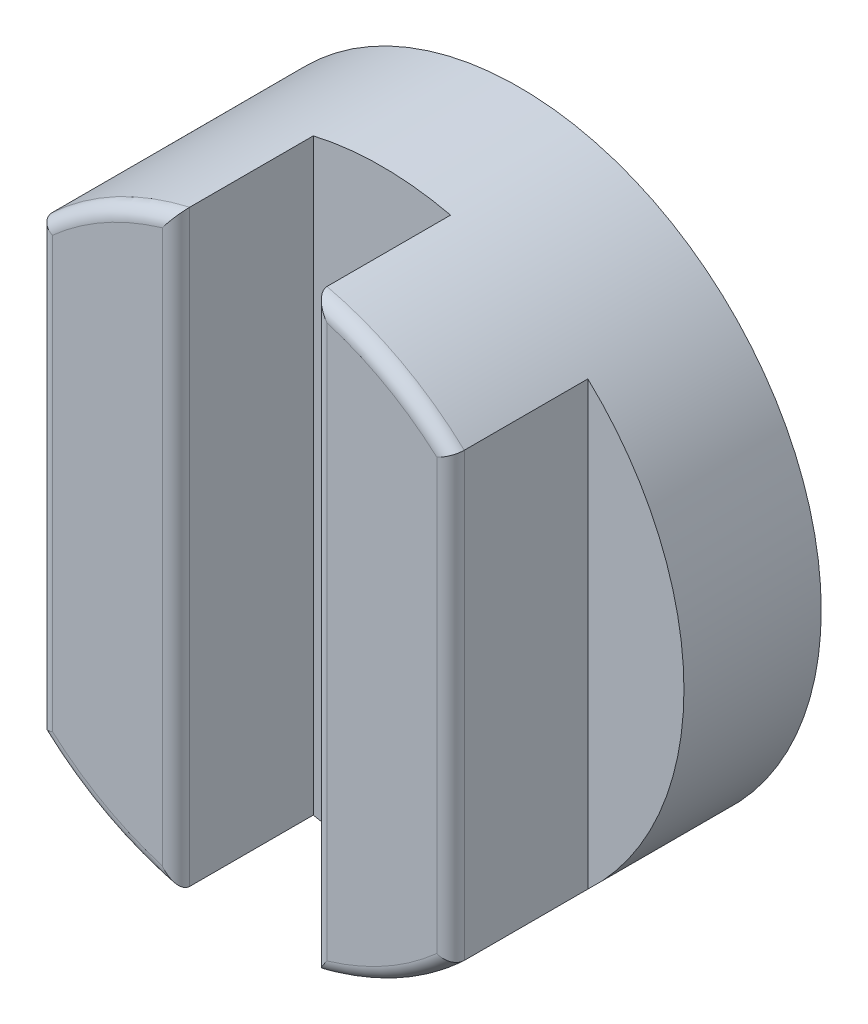
ISO-10303-21;
HEADER;
FILE_DESCRIPTION(('STEP AP214'),'2;1');
FILE_NAME('part.step','',(''),(''),'','','');
FILE_SCHEMA(('AUTOMOTIVE_DESIGN { 1 0 10303 214 1 1 1 1 }'));
ENDSEC;
DATA;
#1=APPLICATION_CONTEXT('core data for automotive mechanical design processes');
#2=APPLICATION_PROTOCOL_DEFINITION('international standard','automotive_design',2000,#1);
#3=PRODUCT_CONTEXT('',#1,'mechanical');
#4=PRODUCT('Part','Part','',(#3));
#5=PRODUCT_RELATED_PRODUCT_CATEGORY('part','',(#4));
#6=PRODUCT_DEFINITION_FORMATION('','',#4);
#7=PRODUCT_DEFINITION_CONTEXT('part definition',#1,'design');
#8=PRODUCT_DEFINITION('design','',#6,#7);
#9=PRODUCT_DEFINITION_SHAPE('','',#8);
#10=(LENGTH_UNIT() NAMED_UNIT(*) SI_UNIT(.MILLI.,.METRE.));
#11=(NAMED_UNIT(*) PLANE_ANGLE_UNIT() SI_UNIT($,.RADIAN.));
#12=(NAMED_UNIT(*) SI_UNIT($,.STERADIAN.) SOLID_ANGLE_UNIT());
#13=UNCERTAINTY_MEASURE_WITH_UNIT(LENGTH_MEASURE(1.E-05),#10,'distance_accuracy_value','');
#14=(GEOMETRIC_REPRESENTATION_CONTEXT(3) GLOBAL_UNCERTAINTY_ASSIGNED_CONTEXT((#13)) GLOBAL_UNIT_ASSIGNED_CONTEXT((#10,
#11,#12)) REPRESENTATION_CONTEXT('',''));
#15=CARTESIAN_POINT('',(0.,0.,0.));
#16=DIRECTION('',(0.,0.,1.));
#17=DIRECTION('',(1.,0.,0.));
#18=AXIS2_PLACEMENT_3D('',#15,#16,#17);
#19=CARTESIAN_POINT('',(0.,0.,5.));
#20=DIRECTION('',(0.,0.,1.));
#21=DIRECTION('',(1.,0.,0.));
#22=AXIS2_PLACEMENT_3D('',#19,#20,#21);
#23=PLANE('',#22);
#24=CARTESIAN_POINT('',(0.,0.,5.));
#25=DIRECTION('',(0.,0.,1.));
#26=DIRECTION('',(1.,0.,0.));
#27=AXIS2_PLACEMENT_3D('',#24,#25,#26);
#28=CIRCLE('',#27,11.);
#29=CARTESIAN_POINT('',(-2.5,-10.7121426428143,5.));
#30=VERTEX_POINT('',#29);
#31=CARTESIAN_POINT('',(2.5,-10.7121426428143,5.));
#32=VERTEX_POINT('',#31);
#33=EDGE_CURVE('E153',#30,#32,#28,.T.);
#34=ORIENTED_EDGE('',*,*,#33,.T.);
#35=DIRECTION('',(0.,-1.,0.));
#36=VECTOR('',#35,1.);
#37=CARTESIAN_POINT('',(2.5,0.,5.));
#38=LINE('',#37,#36);
#39=CARTESIAN_POINT('',(2.5,10.7121426428143,5.));
#40=VERTEX_POINT('',#39);
#41=EDGE_CURVE('E157',#40,#32,#38,.T.);
#42=ORIENTED_EDGE('',*,*,#41,.F.);
#43=CARTESIAN_POINT('',(-2.5,10.7121426428143,5.));
#44=VERTEX_POINT('',#43);
#45=EDGE_CURVE('E154',#40,#44,#28,.T.);
#46=ORIENTED_EDGE('',*,*,#45,.T.);
#47=DIRECTION('',(0.,-1.,0.));
#48=VECTOR('',#47,1.);
#49=CARTESIAN_POINT('',(-2.5,0.,5.));
#50=LINE('',#49,#48);
#51=EDGE_CURVE('E167',#44,#30,#50,.T.);
#52=ORIENTED_EDGE('',*,*,#51,.T.);
#53=EDGE_LOOP('',(#34,#42,#46,#52));
#54=FACE_BOUND('',#53,.T.);
#55=ADVANCED_FACE('F37',(#54),#23,.T.);
#56=DIRECTION('',(0.,-1.,0.));
#57=VECTOR('',#56,1.);
#58=CARTESIAN_POINT('',(7.5,0.,5.));
#59=LINE('',#58,#57);
#60=CARTESIAN_POINT('',(7.5,8.04673846971554,5.));
#61=VERTEX_POINT('',#60);
#62=CARTESIAN_POINT('',(7.5,-8.04673846971554,5.));
#63=VERTEX_POINT('',#62);
#64=EDGE_CURVE('E138',#61,#63,#59,.T.);
#65=ORIENTED_EDGE('',*,*,#64,.T.);
#66=EDGE_CURVE('E147',#63,#61,#28,.T.);
#67=ORIENTED_EDGE('',*,*,#66,.T.);
#68=EDGE_LOOP('',(#65,#67));
#69=FACE_BOUND('',#68,.T.);
#70=ADVANCED_FACE('F156',(#69),#23,.T.);
#71=CARTESIAN_POINT('',(0.,0.,5.));
#72=DIRECTION('',(0.,0.,-1.));
#73=DIRECTION('',(-1.,0.,0.));
#74=AXIS2_PLACEMENT_3D('',#71,#72,#73);
#75=CYLINDRICAL_SURFACE('',#74,11.);
#76=DIRECTION('',(0.,0.,-1.));
#77=VECTOR('',#76,1.);
#78=CARTESIAN_POINT('',(2.5,10.7121426428143,10.));
#79=LINE('',#78,#77);
#80=CARTESIAN_POINT('',(2.5,10.7121426428143,9.5));
#81=VERTEX_POINT('',#80);
#82=EDGE_CURVE('E165',#81,#40,#79,.T.);
#83=ORIENTED_EDGE('',*,*,#82,.F.);
#84=CARTESIAN_POINT('',(0.,0.,9.5));
#85=DIRECTION('',(0.,0.,1.));
#86=DIRECTION('',(1.,0.,0.));
#87=AXIS2_PLACEMENT_3D('',#84,#85,#86);
#88=CIRCLE('',#87,11.);
#89=CARTESIAN_POINT('',(7.5,8.04673846971554,9.5));
#90=VERTEX_POINT('',#89);
#91=EDGE_CURVE('E447',#81,#90,#88,.F.);
#92=ORIENTED_EDGE('',*,*,#91,.T.);
#93=DIRECTION('',(0.,0.,-1.));
#94=VECTOR('',#93,1.);
#95=CARTESIAN_POINT('',(7.5,8.04673846971554,10.));
#96=LINE('',#95,#94);
#97=EDGE_CURVE('E144',#90,#61,#96,.T.);
#98=ORIENTED_EDGE('',*,*,#97,.T.);
#99=ORIENTED_EDGE('',*,*,#66,.F.);
#100=DIRECTION('',(0.,0.,-1.));
#101=VECTOR('',#100,1.);
#102=CARTESIAN_POINT('',(7.5,-8.04673846971554,10.));
#103=LINE('',#102,#101);
#104=CARTESIAN_POINT('',(7.5,-8.04673846971554,9.5));
#105=VERTEX_POINT('',#104);
#106=EDGE_CURVE('E133',#105,#63,#103,.T.);
#107=ORIENTED_EDGE('',*,*,#106,.F.);
#108=CARTESIAN_POINT('',(0.,0.,9.5));
#109=DIRECTION('',(0.,0.,1.));
#110=DIRECTION('',(1.,0.,0.));
#111=AXIS2_PLACEMENT_3D('',#108,#109,#110);
#112=CIRCLE('',#111,11.);
#113=CARTESIAN_POINT('',(2.5,-10.7121426428143,9.5));
#114=VERTEX_POINT('',#113);
#115=EDGE_CURVE('E449',#105,#114,#112,.F.);
#116=ORIENTED_EDGE('',*,*,#115,.T.);
#117=DIRECTION('',(0.,0.,-1.));
#118=VECTOR('',#117,1.);
#119=CARTESIAN_POINT('',(2.5,-10.7121426428143,10.));
#120=LINE('',#119,#118);
#121=EDGE_CURVE('E143',#114,#32,#120,.T.);
#122=ORIENTED_EDGE('',*,*,#121,.T.);
#123=ORIENTED_EDGE('',*,*,#33,.F.);
#124=DIRECTION('',(0.,0.,-1.));
#125=VECTOR('',#124,1.);
#126=CARTESIAN_POINT('',(-2.5,-10.7121426428143,10.));
#127=LINE('',#126,#125);
#128=CARTESIAN_POINT('',(-2.5,-10.7121426428143,9.5));
#129=VERTEX_POINT('',#128);
#130=EDGE_CURVE('E183',#129,#30,#127,.T.);
#131=ORIENTED_EDGE('',*,*,#130,.F.);
#132=CARTESIAN_POINT('',(0.,0.,9.5));
#133=DIRECTION('',(0.,0.,1.));
#134=DIRECTION('',(1.,0.,0.));
#135=AXIS2_PLACEMENT_3D('',#132,#133,#134);
#136=CIRCLE('',#135,11.);
#137=CARTESIAN_POINT('',(-7.5,-8.04673846971554,9.5));
#138=VERTEX_POINT('',#137);
#139=EDGE_CURVE('E240',#129,#138,#136,.F.);
#140=ORIENTED_EDGE('',*,*,#139,.T.);
#141=DIRECTION('',(0.,0.,-1.));
#142=VECTOR('',#141,1.);
#143=CARTESIAN_POINT('',(-7.5,-8.04673846971554,10.));
#144=LINE('',#143,#142);
#145=CARTESIAN_POINT('',(-7.5,-8.04673846971554,5.));
#146=VERTEX_POINT('',#145);
#147=EDGE_CURVE('E186',#138,#146,#144,.T.);
#148=ORIENTED_EDGE('',*,*,#147,.T.);
#149=CARTESIAN_POINT('',(-7.5,8.04673846971554,5.));
#150=VERTEX_POINT('',#149);
#151=EDGE_CURVE('E207',#150,#146,#28,.T.);
#152=ORIENTED_EDGE('',*,*,#151,.F.);
#153=DIRECTION('',(0.,0.,-1.));
#154=VECTOR('',#153,1.);
#155=CARTESIAN_POINT('',(-7.5,8.04673846971554,10.));
#156=LINE('',#155,#154);
#157=CARTESIAN_POINT('',(-7.5,8.04673846971554,9.5));
#158=VERTEX_POINT('',#157);
#159=EDGE_CURVE('E191',#158,#150,#156,.T.);
#160=ORIENTED_EDGE('',*,*,#159,.F.);
#161=CARTESIAN_POINT('',(0.,0.,9.5));
#162=DIRECTION('',(0.,0.,1.));
#163=DIRECTION('',(1.,0.,0.));
#164=AXIS2_PLACEMENT_3D('',#161,#162,#163);
#165=CIRCLE('',#164,11.);
#166=CARTESIAN_POINT('',(-2.5,10.7121426428143,9.5));
#167=VERTEX_POINT('',#166);
#168=EDGE_CURVE('E192',#158,#167,#165,.F.);
#169=ORIENTED_EDGE('',*,*,#168,.T.);
#170=DIRECTION('',(0.,0.,-1.));
#171=VECTOR('',#170,1.);
#172=CARTESIAN_POINT('',(-2.5,10.7121426428143,10.));
#173=LINE('',#172,#171);
#174=EDGE_CURVE('E187',#167,#44,#173,.T.);
#175=ORIENTED_EDGE('',*,*,#174,.T.);
#176=ORIENTED_EDGE('',*,*,#45,.F.);
#177=EDGE_LOOP('',(#83,#92,#98,#99,#107,#116,#122,#123,#131,#140,#148,#152,#160,#169,#175,#176));
#178=FACE_BOUND('',#177,.T.);
#179=CARTESIAN_POINT('',(0.,0.,0.));
#180=DIRECTION('',(0.,0.,1.));
#181=DIRECTION('',(1.,0.,0.));
#182=AXIS2_PLACEMENT_3D('',#179,#180,#181);
#183=CIRCLE('',#182,11.);
#184=CARTESIAN_POINT('',(11.,0.,0.));
#185=VERTEX_POINT('',#184);
#186=EDGE_CURVE('E209',#185,#185,#183,.T.);
#187=ORIENTED_EDGE('',*,*,#186,.T.);
#188=EDGE_LOOP('',(#187));
#189=FACE_BOUND('',#188,.T.);
#190=ADVANCED_FACE('F149',(#178,#189),#75,.T.);
#191=DIRECTION('',(0.,-1.,0.));
#192=VECTOR('',#191,1.);
#193=CARTESIAN_POINT('',(-7.5,0.,5.));
#194=LINE('',#193,#192);
#195=EDGE_CURVE('E176',#150,#146,#194,.T.);
#196=ORIENTED_EDGE('',*,*,#195,.F.);
#197=ORIENTED_EDGE('',*,*,#151,.T.);
#198=EDGE_LOOP('',(#196,#197));
#199=FACE_BOUND('',#198,.T.);
#200=ADVANCED_FACE('F224',(#199),#23,.T.);
#201=CARTESIAN_POINT('',(0.,0.,0.));
#202=DIRECTION('',(0.,0.,1.));
#203=DIRECTION('',(1.,0.,0.));
#204=AXIS2_PLACEMENT_3D('',#201,#202,#203);
#205=PLANE('',#204);
#206=ORIENTED_EDGE('',*,*,#186,.F.);
#207=EDGE_LOOP('',(#206));
#208=FACE_BOUND('',#207,.T.);
#209=ADVANCED_FACE('F309',(#208),#205,.F.);
#210=CARTESIAN_POINT('',(-2.5,0.,10.));
#211=DIRECTION('',(1.,0.,0.));
#212=DIRECTION('',(0.,0.,-1.));
#213=AXIS2_PLACEMENT_3D('',#210,#211,#212);
#214=PLANE('',#213);
#215=ORIENTED_EDGE('',*,*,#174,.F.);
#216=DIRECTION('',(0.,-1.,0.));
#217=VECTOR('',#216,1.);
#218=CARTESIAN_POINT('',(-2.5,0.,9.5));
#219=LINE('',#218,#217);
#220=EDGE_CURVE('E50',#167,#129,#219,.T.);
#221=ORIENTED_EDGE('',*,*,#220,.T.);
#222=ORIENTED_EDGE('',*,*,#130,.T.);
#223=ORIENTED_EDGE('',*,*,#51,.F.);
#224=EDGE_LOOP('',(#215,#221,#222,#223));
#225=FACE_BOUND('',#224,.T.);
#226=ADVANCED_FACE('F312',(#225),#214,.T.);
#227=CARTESIAN_POINT('',(-7.5,0.,10.));
#228=DIRECTION('',(1.,0.,0.));
#229=DIRECTION('',(0.,0.,-1.));
#230=AXIS2_PLACEMENT_3D('',#227,#228,#229);
#231=PLANE('',#230);
#232=ORIENTED_EDGE('',*,*,#147,.F.);
#233=DIRECTION('',(0.,-1.,0.));
#234=VECTOR('',#233,1.);
#235=CARTESIAN_POINT('',(-7.5,8.04673846971554,9.5));
#236=LINE('',#235,#234);
#237=EDGE_CURVE('E11',#138,#158,#236,.F.);
#238=ORIENTED_EDGE('',*,*,#237,.T.);
#239=ORIENTED_EDGE('',*,*,#159,.T.);
#240=ORIENTED_EDGE('',*,*,#195,.T.);
#241=EDGE_LOOP('',(#232,#238,#239,#240));
#242=FACE_BOUND('',#241,.T.);
#243=ADVANCED_FACE('F228',(#242),#231,.F.);
#244=CARTESIAN_POINT('',(0.,0.,10.));
#245=DIRECTION('',(0.,0.,1.));
#246=DIRECTION('',(1.,0.,0.));
#247=AXIS2_PLACEMENT_3D('',#244,#245,#246);
#248=PLANE('',#247);
#249=DIRECTION('',(0.,-1.,0.));
#250=VECTOR('',#249,1.);
#251=CARTESIAN_POINT('',(-7.,-8.04673846971554,10.));
#252=LINE('',#251,#250);
#253=CARTESIAN_POINT('',(-7.,7.82623792124927,10.));
#254=VERTEX_POINT('',#253);
#255=CARTESIAN_POINT('',(-7.,-7.82623792124927,10.));
#256=VERTEX_POINT('',#255);
#257=EDGE_CURVE('E245',#254,#256,#252,.T.);
#258=ORIENTED_EDGE('',*,*,#257,.T.);
#259=CARTESIAN_POINT('',(0.,0.,10.));
#260=DIRECTION('',(0.,0.,1.));
#261=DIRECTION('',(1.,0.,0.));
#262=AXIS2_PLACEMENT_3D('',#259,#260,#261);
#263=CIRCLE('',#262,10.5);
#264=CARTESIAN_POINT('',(-3.,-10.0623058987491,10.));
#265=VERTEX_POINT('',#264);
#266=EDGE_CURVE('E436',#256,#265,#263,.T.);
#267=ORIENTED_EDGE('',*,*,#266,.T.);
#268=DIRECTION('',(0.,-1.,0.));
#269=VECTOR('',#268,1.);
#270=CARTESIAN_POINT('',(-3.,0.,10.));
#271=LINE('',#270,#269);
#272=CARTESIAN_POINT('',(-3.,10.0623058987491,10.));
#273=VERTEX_POINT('',#272);
#274=EDGE_CURVE('E65',#265,#273,#271,.F.);
#275=ORIENTED_EDGE('',*,*,#274,.T.);
#276=CARTESIAN_POINT('',(0.,0.,10.));
#277=DIRECTION('',(0.,0.,1.));
#278=DIRECTION('',(1.,0.,0.));
#279=AXIS2_PLACEMENT_3D('',#276,#277,#278);
#280=CIRCLE('',#279,10.5);
#281=EDGE_CURVE('E439',#273,#254,#280,.T.);
#282=ORIENTED_EDGE('',*,*,#281,.T.);
#283=EDGE_LOOP('',(#258,#267,#275,#282));
#284=FACE_BOUND('',#283,.T.);
#285=ADVANCED_FACE('F321',(#284),#248,.T.);
#286=CARTESIAN_POINT('',(2.5,0.,10.));
#287=DIRECTION('',(1.,0.,0.));
#288=DIRECTION('',(0.,1.,0.));
#289=AXIS2_PLACEMENT_3D('',#286,#287,#288);
#290=PLANE('',#289);
#291=ORIENTED_EDGE('',*,*,#121,.F.);
#292=DIRECTION('',(0.,-1.,0.));
#293=VECTOR('',#292,1.);
#294=CARTESIAN_POINT('',(2.5,10.7121426428143,9.5));
#295=LINE('',#294,#293);
#296=EDGE_CURVE('E444',#114,#81,#295,.F.);
#297=ORIENTED_EDGE('',*,*,#296,.T.);
#298=ORIENTED_EDGE('',*,*,#82,.T.);
#299=ORIENTED_EDGE('',*,*,#41,.T.);
#300=EDGE_LOOP('',(#291,#297,#298,#299));
#301=FACE_BOUND('',#300,.T.);
#302=ADVANCED_FACE('F324',(#301),#290,.F.);
#303=CARTESIAN_POINT('',(7.5,0.,10.));
#304=DIRECTION('',(1.,0.,0.));
#305=DIRECTION('',(0.,1.,0.));
#306=AXIS2_PLACEMENT_3D('',#303,#304,#305);
#307=PLANE('',#306);
#308=ORIENTED_EDGE('',*,*,#97,.F.);
#309=DIRECTION('',(0.,-1.,0.));
#310=VECTOR('',#309,1.);
#311=CARTESIAN_POINT('',(7.5,0.,9.5));
#312=LINE('',#311,#310);
#313=EDGE_CURVE('E140',#90,#105,#312,.T.);
#314=ORIENTED_EDGE('',*,*,#313,.T.);
#315=ORIENTED_EDGE('',*,*,#106,.T.);
#316=ORIENTED_EDGE('',*,*,#64,.F.);
#317=EDGE_LOOP('',(#308,#314,#315,#316));
#318=FACE_BOUND('',#317,.T.);
#319=ADVANCED_FACE('F136',(#318),#307,.T.);
#320=CARTESIAN_POINT('',(0.,0.,10.));
#321=DIRECTION('',(0.,0.,1.));
#322=DIRECTION('',(1.,0.,0.));
#323=AXIS2_PLACEMENT_3D('',#320,#321,#322);
#324=PLANE('',#323);
#325=DIRECTION('',(0.,-1.,0.));
#326=VECTOR('',#325,1.);
#327=CARTESIAN_POINT('',(7.,0.,10.));
#328=LINE('',#327,#326);
#329=CARTESIAN_POINT('',(7.,-7.82623792124926,10.));
#330=VERTEX_POINT('',#329);
#331=CARTESIAN_POINT('',(7.,7.82623792124927,10.));
#332=VERTEX_POINT('',#331);
#333=EDGE_CURVE('E202',#330,#332,#328,.F.);
#334=ORIENTED_EDGE('',*,*,#333,.T.);
#335=CARTESIAN_POINT('',(0.,0.,10.));
#336=DIRECTION('',(0.,0.,1.));
#337=DIRECTION('',(1.,0.,0.));
#338=AXIS2_PLACEMENT_3D('',#335,#336,#337);
#339=CIRCLE('',#338,10.5);
#340=CARTESIAN_POINT('',(3.,10.0623058987491,10.));
#341=VERTEX_POINT('',#340);
#342=EDGE_CURVE('E199',#332,#341,#339,.T.);
#343=ORIENTED_EDGE('',*,*,#342,.T.);
#344=DIRECTION('',(0.,-1.,0.));
#345=VECTOR('',#344,1.);
#346=CARTESIAN_POINT('',(3.,-10.7121426428143,10.));
#347=LINE('',#346,#345);
#348=CARTESIAN_POINT('',(3.,-10.0623058987491,10.));
#349=VERTEX_POINT('',#348);
#350=EDGE_CURVE('E204',#341,#349,#347,.T.);
#351=ORIENTED_EDGE('',*,*,#350,.T.);
#352=CARTESIAN_POINT('',(0.,0.,10.));
#353=DIRECTION('',(0.,0.,1.));
#354=DIRECTION('',(1.,0.,0.));
#355=AXIS2_PLACEMENT_3D('',#352,#353,#354);
#356=CIRCLE('',#355,10.5);
#357=EDGE_CURVE('E206',#349,#330,#356,.T.);
#358=ORIENTED_EDGE('',*,*,#357,.T.);
#359=EDGE_LOOP('',(#334,#343,#351,#358));
#360=FACE_BOUND('',#359,.T.);
#361=ADVANCED_FACE('F330',(#360),#324,.T.);
#362=CARTESIAN_POINT('',(0.,0.,9.5));
#363=DIRECTION('',(0.,0.,1.));
#364=DIRECTION('',(1.,0.,0.));
#365=AXIS2_PLACEMENT_3D('',#362,#363,#364);
#366=TOROIDAL_SURFACE('',#365,10.5,0.5);
#367=CARTESIAN_POINT('',(2.5,-10.7121426428143,9.5));
#368=CARTESIAN_POINT('',(2.49996102082083,-10.712190551386,9.52089504209898));
#369=CARTESIAN_POINT('',(2.50130713614697,-10.7104953814485,9.54171498651779));
#370=CARTESIAN_POINT('',(2.50641733178575,-10.7040529114052,9.58233970078138));
#371=CARTESIAN_POINT('',(2.5101540959395,-10.6993400912261,9.60215324372889));
#372=CARTESIAN_POINT('',(2.51968788544689,-10.6873037087454,9.64032024242776));
#373=CARTESIAN_POINT('',(2.52547651934836,-10.6799907796413,9.65867927789985));
#374=CARTESIAN_POINT('',(2.5387073511611,-10.6632533742631,9.69380926829147));
#375=CARTESIAN_POINT('',(2.54615445015105,-10.6538226387633,9.71057530162177));
#376=CARTESIAN_POINT('',(2.56645961725308,-10.6280679261379,9.75054341482953));
#377=CARTESIAN_POINT('',(2.58013584453227,-10.6106868758132,9.77264541887833));
#378=CARTESIAN_POINT('',(2.60938900068101,-10.5734028706716,9.81312760250655));
#379=CARTESIAN_POINT('',(2.62496998788826,-10.5534945275388,9.83149960535116));
#380=CARTESIAN_POINT('',(2.66652512900634,-10.5002318749779,9.87433015625739));
#381=CARTESIAN_POINT('',(2.69339738847029,-10.4656360775751,9.89636240717));
#382=CARTESIAN_POINT('',(2.74867407631449,-10.3940892548202,9.93352659061515));
#383=CARTESIAN_POINT('',(2.77708142312817,-10.3571337171657,9.94864482270812));
#384=CARTESIAN_POINT('',(2.83734390842895,-10.278298060365,9.97403652185121));
#385=CARTESIAN_POINT('',(2.8692702288164,-10.2362836103483,9.98371336542192));
#386=CARTESIAN_POINT('',(2.93327306147399,-10.1515230970111,9.99659824652636));
#387=CARTESIAN_POINT('',(2.96534917173785,-10.1087785799817,9.99981857271174));
#388=CARTESIAN_POINT('',(2.99817983527969,-10.0647476851721,9.99999750582159));
#389=CARTESIAN_POINT('',(2.99908998398372,-10.0635268146862,9.99999998962548));
#390=CARTESIAN_POINT('',(3.,-10.0623058987491,10.));
#391=B_SPLINE_CURVE_WITH_KNOTS('',3,(#367,#368,#369,#370,#371,#372,#373,#374,#375,#376,#377,
#378,#379,#380,#381,#382,#383,#384,#385,#386,#387,#388,#389,#390),.UNSPECIFIED.,.F.,.F.,(4,2,2,
2,2,2,2,2,2,2,2,4),(0.,0.0624542842721568,0.124207394443703,0.185710815062538,0.247398460410433,
0.340671425224973,0.434146701966049,0.580438010852635,0.727017959731676,0.887521650525739,
1.04771956447976,1.0522879365741),.UNSPECIFIED.);
#392=EDGE_CURVE('E279',#114,#349,#391,.T.);
#393=ORIENTED_EDGE('',*,*,#392,.F.);
#394=ORIENTED_EDGE('',*,*,#115,.F.);
#395=CARTESIAN_POINT('',(7.5,-8.04673846971554,9.5));
#396=CARTESIAN_POINT('',(7.50003039043677,-8.0467510908343,9.52644227248441));
#397=CARTESIAN_POINT('',(7.49790453485716,-8.04582702517562,9.55286418149066));
#398=CARTESIAN_POINT('',(7.48957935278205,-8.04220499974266,9.60485591057661));
#399=CARTESIAN_POINT('',(7.48339210233459,-8.03951229876871,9.63042802133253));
#400=CARTESIAN_POINT('',(7.4671832466899,-8.03245257447803,9.68006594685893));
#401=CARTESIAN_POINT('',(7.45716288571508,-8.02808609446671,9.70413224746687));
#402=CARTESIAN_POINT('',(7.43368151820787,-8.01784241275407,9.75017629084598));
#403=CARTESIAN_POINT('',(7.42021907052803,-8.01196457826658,9.77215315350226));
#404=CARTESIAN_POINT('',(7.38982059914549,-7.9986742412941,9.81422255265952));
#405=CARTESIAN_POINT('',(7.37278386617692,-7.99121716662868,9.83422801331846));
#406=CARTESIAN_POINT('',(7.33608624140873,-7.97512811042913,9.87111103343869));
#407=CARTESIAN_POINT('',(7.31642451806617,-7.96649575657351,9.88798759766658));
#408=CARTESIAN_POINT('',(7.27340206128314,-7.94757262966248,9.91954486806715));
#409=CARTESIAN_POINT('',(7.24987199094227,-7.93720480344111,9.93394820449548));
#410=CARTESIAN_POINT('',(7.20106832424367,-7.91565501466346,9.95860590162016));
#411=CARTESIAN_POINT('',(7.17579396575537,-7.9044726961119,9.96885843510305));
#412=CARTESIAN_POINT('',(7.12635583016624,-7.88255039422008,9.98440474183506));
#413=CARTESIAN_POINT('',(7.10228052232726,-7.87185372432952,9.99004619879169));
#414=CARTESIAN_POINT('',(7.05370464284015,-7.85022604628673,9.99771320194017));
#415=CARTESIAN_POINT('',(7.02920501023017,-7.83929554545778,9.99974590367501));
#416=CARTESIAN_POINT('',(7.00315242269633,-7.82764763302762,9.99999256267343));
#417=CARTESIAN_POINT('',(7.00157612810876,-7.82694278797732,10.0000000170897));
#418=CARTESIAN_POINT('',(7.,-7.82623792124926,10.));
#419=B_SPLINE_CURVE_WITH_KNOTS('',3,(#395,#396,#397,#398,#399,#400,#401,#402,#403,#404,#405,
#406,#407,#408,#409,#410,#411,#412,#413,#414,#415,#416,#417,#418),.UNSPECIFIED.,.F.,.F.,(4,2,2,
2,2,2,2,2,2,2,2,4),(0.,0.0791937645245632,0.158153116509821,0.237086860116497,0.316053706310543,
0.397649154419396,0.479270511891107,0.567315932915353,0.655400070137616,0.735989832441275,
0.816419619834479,0.82159970823772),.UNSPECIFIED.);
#420=EDGE_CURVE('E161',#330,#105,#419,.F.);
#421=ORIENTED_EDGE('',*,*,#420,.F.);
#422=ORIENTED_EDGE('',*,*,#357,.F.);
#423=EDGE_LOOP('',(#393,#394,#421,#422));
#424=FACE_BOUND('',#423,.T.);
#425=ADVANCED_FACE('F285',(#424),#366,.T.);
#426=CARTESIAN_POINT('',(7.,0.,9.5));
#427=DIRECTION('',(0.,-1.,0.));
#428=DIRECTION('',(1.,0.,0.));
#429=AXIS2_PLACEMENT_3D('',#426,#427,#428);
#430=CYLINDRICAL_SURFACE('',#429,0.5);
#431=ORIENTED_EDGE('',*,*,#420,.T.);
#432=ORIENTED_EDGE('',*,*,#313,.F.);
#433=CARTESIAN_POINT('',(7.5,8.04673846971554,9.5));
#434=CARTESIAN_POINT('',(7.50003039043677,8.0467510908343,9.52644227248441));
#435=CARTESIAN_POINT('',(7.49790453485715,8.04582702517562,9.55286418149066));
#436=CARTESIAN_POINT('',(7.48957935278205,8.04220499974267,9.60485591057661));
#437=CARTESIAN_POINT('',(7.48339210233459,8.03951229876872,9.63042802133253));
#438=CARTESIAN_POINT('',(7.46718324668989,8.03245257447803,9.68006594685893));
#439=CARTESIAN_POINT('',(7.45716288571507,8.02808609446672,9.70413224746687));
#440=CARTESIAN_POINT('',(7.43368151820787,8.01784241275407,9.75017629084598));
#441=CARTESIAN_POINT('',(7.42021907052802,8.01196457826658,9.77215315350226));
#442=CARTESIAN_POINT('',(7.38982059914549,7.9986742412941,9.81422255265952));
#443=CARTESIAN_POINT('',(7.37278386617691,7.99121716662869,9.83422801331846));
#444=CARTESIAN_POINT('',(7.33608624140873,7.97512811042913,9.87111103343869));
#445=CARTESIAN_POINT('',(7.31642451806616,7.96649575657352,9.88798759766658));
#446=CARTESIAN_POINT('',(7.27340206128313,7.94757262966248,9.91954486806715));
#447=CARTESIAN_POINT('',(7.24987199094227,7.93720480344111,9.93394820449548));
#448=CARTESIAN_POINT('',(7.20106832424367,7.91565501466346,9.95860590162016));
#449=CARTESIAN_POINT('',(7.17579396575537,7.90447269611189,9.96885843510305));
#450=CARTESIAN_POINT('',(7.12635583016623,7.88255039422009,9.98440474183506));
#451=CARTESIAN_POINT('',(7.10228052232725,7.87185372432954,9.99004619879169));
#452=CARTESIAN_POINT('',(7.05370464284016,7.85022604628672,9.99771320194017));
#453=CARTESIAN_POINT('',(7.0292050102302,7.83929554545771,9.99974590367501));
#454=CARTESIAN_POINT('',(7.00315242269633,7.82764763302761,9.99999256267343));
#455=CARTESIAN_POINT('',(7.00157612810876,7.82694278797731,10.0000000170897));
#456=CARTESIAN_POINT('',(7.,7.82623792124926,10.));
#457=B_SPLINE_CURVE_WITH_KNOTS('',3,(#433,#434,#435,#436,#437,#438,#439,#440,#441,#442,#443,
#444,#445,#446,#447,#448,#449,#450,#451,#452,#453,#454,#455,#456),.UNSPECIFIED.,.F.,.F.,(4,2,2,
2,2,2,2,2,2,2,2,4),(0.,0.0791937645245632,0.158153116509821,0.237086860116497,0.316053706310543,
0.397649154419397,0.479270511891107,0.567315932915353,0.655400070137616,0.735989832441273,
0.81641961983448,0.821599708237721),.UNSPECIFIED.);
#458=EDGE_CURVE('E247',#332,#90,#457,.F.);
#459=ORIENTED_EDGE('',*,*,#458,.F.);
#460=ORIENTED_EDGE('',*,*,#333,.F.);
#461=EDGE_LOOP('',(#431,#432,#459,#460));
#462=FACE_BOUND('',#461,.T.);
#463=ADVANCED_FACE('F287',(#462),#430,.T.);
#464=CARTESIAN_POINT('',(3.,0.,9.5));
#465=DIRECTION('',(0.,1.,0.));
#466=DIRECTION('',(-1.,0.,0.));
#467=AXIS2_PLACEMENT_3D('',#464,#465,#466);
#468=CYLINDRICAL_SURFACE('',#467,0.5);
#469=ORIENTED_EDGE('',*,*,#392,.T.);
#470=ORIENTED_EDGE('',*,*,#350,.F.);
#471=CARTESIAN_POINT('',(2.5,10.7121426428143,9.5));
#472=CARTESIAN_POINT('',(2.49996102082082,10.712190551386,9.52089504209898));
#473=CARTESIAN_POINT('',(2.50130713614697,10.7104953814485,9.54171498651779));
#474=CARTESIAN_POINT('',(2.50641733178575,10.7040529114052,9.58233970078138));
#475=CARTESIAN_POINT('',(2.5101540959395,10.6993400912261,9.60215324372889));
#476=CARTESIAN_POINT('',(2.51968788544689,10.6873037087454,9.64032024242776));
#477=CARTESIAN_POINT('',(2.52547651934836,10.6799907796413,9.65867927789985));
#478=CARTESIAN_POINT('',(2.53870735116109,10.6632533742631,9.69380926829147));
#479=CARTESIAN_POINT('',(2.54615445015105,10.6538226387633,9.71057530162177));
#480=CARTESIAN_POINT('',(2.56645961725308,10.6280679261379,9.75054341482953));
#481=CARTESIAN_POINT('',(2.58013584453226,10.6106868758132,9.77264541887833));
#482=CARTESIAN_POINT('',(2.60938900068101,10.5734028706716,9.81312760250655));
#483=CARTESIAN_POINT('',(2.62496998788826,10.5534945275388,9.83149960535117));
#484=CARTESIAN_POINT('',(2.66652512900634,10.5002318749779,9.87433015625739));
#485=CARTESIAN_POINT('',(2.69339738847029,10.4656360775751,9.89636240717001));
#486=CARTESIAN_POINT('',(2.74867407631449,10.3940892548202,9.93352659061515));
#487=CARTESIAN_POINT('',(2.77708142312817,10.3571337171657,9.94864482270812));
#488=CARTESIAN_POINT('',(2.83734390842895,10.278298060365,9.97403652185121));
#489=CARTESIAN_POINT('',(2.86927022881641,10.2362836103483,9.98371336542192));
#490=CARTESIAN_POINT('',(2.93327306147398,10.1515230970111,9.99659824652637));
#491=CARTESIAN_POINT('',(2.96534917173783,10.1087785799816,9.99981857271174));
#492=CARTESIAN_POINT('',(2.99817983527969,10.0647476851721,9.99999750582159));
#493=CARTESIAN_POINT('',(2.99908998398372,10.0635268146862,9.99999998962548));
#494=CARTESIAN_POINT('',(3.,10.0623058987491,10.));
#495=B_SPLINE_CURVE_WITH_KNOTS('',3,(#471,#472,#473,#474,#475,#476,#477,#478,#479,#480,#481,
#482,#483,#484,#485,#486,#487,#488,#489,#490,#491,#492,#493,#494),.UNSPECIFIED.,.F.,.F.,(4,2,2,
2,2,2,2,2,2,2,2,4),(0.,0.0624542842721568,0.124207394443703,0.185710815062536,0.247398460410435,
0.340671425224974,0.434146701966052,0.58043801085264,0.727017959731681,0.887521650525744,
1.04771956447976,1.0522879365741),.UNSPECIFIED.);
#496=EDGE_CURVE('E246',#81,#341,#495,.T.);
#497=ORIENTED_EDGE('',*,*,#496,.F.);
#498=ORIENTED_EDGE('',*,*,#296,.F.);
#499=EDGE_LOOP('',(#469,#470,#497,#498));
#500=FACE_BOUND('',#499,.T.);
#501=ADVANCED_FACE('F290',(#500),#468,.T.);
#502=CARTESIAN_POINT('',(0.,0.,9.5));
#503=DIRECTION('',(0.,0.,1.));
#504=DIRECTION('',(1.,0.,0.));
#505=AXIS2_PLACEMENT_3D('',#502,#503,#504);
#506=TOROIDAL_SURFACE('',#505,10.5,0.5);
#507=ORIENTED_EDGE('',*,*,#458,.T.);
#508=ORIENTED_EDGE('',*,*,#91,.F.);
#509=ORIENTED_EDGE('',*,*,#496,.T.);
#510=ORIENTED_EDGE('',*,*,#342,.F.);
#511=EDGE_LOOP('',(#507,#508,#509,#510));
#512=FACE_BOUND('',#511,.T.);
#513=ADVANCED_FACE('F301',(#512),#506,.T.);
#514=CARTESIAN_POINT('',(0.,0.,9.5));
#515=DIRECTION('',(0.,0.,1.));
#516=DIRECTION('',(1.,0.,0.));
#517=AXIS2_PLACEMENT_3D('',#514,#515,#516);
#518=TOROIDAL_SURFACE('',#517,10.5,0.5);
#519=CARTESIAN_POINT('',(-2.5,10.7121426428143,9.5));
#520=CARTESIAN_POINT('',(-2.49996102082082,10.712190551386,9.52089504209898));
#521=CARTESIAN_POINT('',(-2.50130713614697,10.7104953814485,9.54171498651779));
#522=CARTESIAN_POINT('',(-2.50641733178575,10.7040529114052,9.58233970078138));
#523=CARTESIAN_POINT('',(-2.5101540959395,10.6993400912261,9.60215324372889));
#524=CARTESIAN_POINT('',(-2.51968788544689,10.6873037087454,9.64032024242776));
#525=CARTESIAN_POINT('',(-2.52547651934836,10.6799907796413,9.65867927789985));
#526=CARTESIAN_POINT('',(-2.53870735116109,10.6632533742631,9.69380926829147));
#527=CARTESIAN_POINT('',(-2.54615445015105,10.6538226387633,9.71057530162177));
#528=CARTESIAN_POINT('',(-2.56645961725308,10.6280679261379,9.75054341482953));
#529=CARTESIAN_POINT('',(-2.58013584453226,10.6106868758132,9.77264541887833));
#530=CARTESIAN_POINT('',(-2.60938900068101,10.5734028706716,9.81312760250655));
#531=CARTESIAN_POINT('',(-2.62496998788826,10.5534945275388,9.83149960535116));
#532=CARTESIAN_POINT('',(-2.66652512900634,10.5002318749779,9.87433015625739));
#533=CARTESIAN_POINT('',(-2.69339738847029,10.4656360775751,9.89636240717));
#534=CARTESIAN_POINT('',(-2.74867407631449,10.3940892548202,9.93352659061515));
#535=CARTESIAN_POINT('',(-2.77708142312817,10.3571337171657,9.94864482270812));
#536=CARTESIAN_POINT('',(-2.83734390842895,10.278298060365,9.97403652185121));
#537=CARTESIAN_POINT('',(-2.8692702288164,10.2362836103483,9.98371336542192));
#538=CARTESIAN_POINT('',(-2.93327306147398,10.1515230970111,9.99659824652636));
#539=CARTESIAN_POINT('',(-2.96534917173785,10.1087785799817,9.99981857271174));
#540=CARTESIAN_POINT('',(-2.99817983527969,10.0647476851721,9.99999750582159));
#541=CARTESIAN_POINT('',(-2.99908998398372,10.0635268146862,9.99999998962548));
#542=CARTESIAN_POINT('',(-3.,10.0623058987491,10.));
#543=B_SPLINE_CURVE_WITH_KNOTS('',3,(#519,#520,#521,#522,#523,#524,#525,#526,#527,#528,#529,
#530,#531,#532,#533,#534,#535,#536,#537,#538,#539,#540,#541,#542),.UNSPECIFIED.,.F.,.F.,(4,2,2,
2,2,2,2,2,2,2,2,4),(0.,0.0624542842721568,0.124207394443703,0.185710815062536,0.247398460410435,
0.340671425224973,0.43414670196605,0.580438010852636,0.727017959731676,0.887521650525742,
1.04771956447976,1.0522879365741),.UNSPECIFIED.);
#544=EDGE_CURVE('E238',#167,#273,#543,.T.);
#545=ORIENTED_EDGE('',*,*,#544,.F.);
#546=ORIENTED_EDGE('',*,*,#168,.F.);
#547=CARTESIAN_POINT('',(-7.5,8.04673846971554,9.5));
#548=CARTESIAN_POINT('',(-7.50003039043677,8.0467510908343,9.52644227248441));
#549=CARTESIAN_POINT('',(-7.49790453485715,8.04582702517562,9.55286418149066));
#550=CARTESIAN_POINT('',(-7.48957935278205,8.04220499974267,9.60485591057661));
#551=CARTESIAN_POINT('',(-7.48339210233459,8.03951229876872,9.63042802133253));
#552=CARTESIAN_POINT('',(-7.46718324668989,8.03245257447803,9.68006594685893));
#553=CARTESIAN_POINT('',(-7.45716288571507,8.02808609446672,9.70413224746687));
#554=CARTESIAN_POINT('',(-7.43368151820787,8.01784241275407,9.75017629084598));
#555=CARTESIAN_POINT('',(-7.42021907052802,8.01196457826658,9.77215315350226));
#556=CARTESIAN_POINT('',(-7.38982059914549,7.9986742412941,9.81422255265952));
#557=CARTESIAN_POINT('',(-7.37278386617691,7.99121716662869,9.83422801331846));
#558=CARTESIAN_POINT('',(-7.33608624140873,7.97512811042913,9.87111103343869));
#559=CARTESIAN_POINT('',(-7.31642451806616,7.96649575657352,9.88798759766658));
#560=CARTESIAN_POINT('',(-7.27340206128313,7.94757262966248,9.91954486806715));
#561=CARTESIAN_POINT('',(-7.24987199094227,7.93720480344111,9.93394820449548));
#562=CARTESIAN_POINT('',(-7.20106832424367,7.91565501466346,9.95860590162016));
#563=CARTESIAN_POINT('',(-7.17579396575537,7.90447269611189,9.96885843510305));
#564=CARTESIAN_POINT('',(-7.12635583016623,7.88255039422009,9.98440474183506));
#565=CARTESIAN_POINT('',(-7.10228052232725,7.87185372432954,9.99004619879169));
#566=CARTESIAN_POINT('',(-7.05370464284016,7.85022604628672,9.99771320194017));
#567=CARTESIAN_POINT('',(-7.0292050102302,7.83929554545771,9.99974590367501));
#568=CARTESIAN_POINT('',(-7.00315242269633,7.82764763302761,9.99999256267343));
#569=CARTESIAN_POINT('',(-7.00157612810876,7.82694278797731,10.0000000170897));
#570=CARTESIAN_POINT('',(-7.,7.82623792124926,10.));
#571=B_SPLINE_CURVE_WITH_KNOTS('',3,(#547,#548,#549,#550,#551,#552,#553,#554,#555,#556,#557,
#558,#559,#560,#561,#562,#563,#564,#565,#566,#567,#568,#569,#570),.UNSPECIFIED.,.F.,.F.,(4,2,2,
2,2,2,2,2,2,2,2,4),(0.,0.0791937645245632,0.158153116509821,0.237086860116497,0.316053706310543,
0.397649154419397,0.479270511891107,0.567315932915353,0.655400070137616,0.735989832441273,
0.81641961983448,0.821599708237721),.UNSPECIFIED.);
#572=EDGE_CURVE('E42',#254,#158,#571,.F.);
#573=ORIENTED_EDGE('',*,*,#572,.F.);
#574=ORIENTED_EDGE('',*,*,#281,.F.);
#575=EDGE_LOOP('',(#545,#546,#573,#574));
#576=FACE_BOUND('',#575,.T.);
#577=ADVANCED_FACE('F39',(#576),#518,.T.);
#578=CARTESIAN_POINT('',(-7.,0.,9.5));
#579=DIRECTION('',(0.,1.,0.));
#580=DIRECTION('',(0.,0.,1.));
#581=AXIS2_PLACEMENT_3D('',#578,#579,#580);
#582=CYLINDRICAL_SURFACE('',#581,0.5);
#583=ORIENTED_EDGE('',*,*,#572,.T.);
#584=ORIENTED_EDGE('',*,*,#237,.F.);
#585=CARTESIAN_POINT('',(-7.5,-8.04673846971554,9.5));
#586=CARTESIAN_POINT('',(-7.50003039043677,-8.0467510908343,9.52644227248441));
#587=CARTESIAN_POINT('',(-7.49790453485715,-8.04582702517562,9.55286418149066));
#588=CARTESIAN_POINT('',(-7.48957935278205,-8.04220499974267,9.60485591057661));
#589=CARTESIAN_POINT('',(-7.48339210233459,-8.03951229876872,9.63042802133253));
#590=CARTESIAN_POINT('',(-7.46718324668989,-8.03245257447803,9.68006594685893));
#591=CARTESIAN_POINT('',(-7.45716288571507,-8.02808609446672,9.70413224746687));
#592=CARTESIAN_POINT('',(-7.43368151820787,-8.01784241275407,9.75017629084598));
#593=CARTESIAN_POINT('',(-7.42021907052802,-8.01196457826658,9.77215315350226));
#594=CARTESIAN_POINT('',(-7.38982059914549,-7.9986742412941,9.81422255265952));
#595=CARTESIAN_POINT('',(-7.37278386617691,-7.99121716662869,9.83422801331846));
#596=CARTESIAN_POINT('',(-7.33608624140873,-7.97512811042913,9.87111103343869));
#597=CARTESIAN_POINT('',(-7.31642451806616,-7.96649575657352,9.88798759766658));
#598=CARTESIAN_POINT('',(-7.27340206128313,-7.94757262966248,9.91954486806715));
#599=CARTESIAN_POINT('',(-7.24987199094227,-7.93720480344111,9.93394820449548));
#600=CARTESIAN_POINT('',(-7.20106832424367,-7.91565501466346,9.95860590162016));
#601=CARTESIAN_POINT('',(-7.17579396575537,-7.90447269611189,9.96885843510305));
#602=CARTESIAN_POINT('',(-7.12635583016623,-7.88255039422009,9.98440474183506));
#603=CARTESIAN_POINT('',(-7.10228052232725,-7.87185372432954,9.99004619879169));
#604=CARTESIAN_POINT('',(-7.05370464284016,-7.85022604628672,9.99771320194017));
#605=CARTESIAN_POINT('',(-7.0292050102302,-7.83929554545771,9.99974590367501));
#606=CARTESIAN_POINT('',(-7.00315242269633,-7.82764763302761,9.99999256267343));
#607=CARTESIAN_POINT('',(-7.00157612810876,-7.82694278797731,10.0000000170897));
#608=CARTESIAN_POINT('',(-7.,-7.82623792124926,10.));
#609=B_SPLINE_CURVE_WITH_KNOTS('',3,(#585,#586,#587,#588,#589,#590,#591,#592,#593,#594,#595,
#596,#597,#598,#599,#600,#601,#602,#603,#604,#605,#606,#607,#608),.UNSPECIFIED.,.F.,.F.,(4,2,2,
2,2,2,2,2,2,2,2,4),(0.,0.0791937645245632,0.158153116509821,0.237086860116497,0.316053706310543,
0.397649154419397,0.479270511891107,0.567315932915353,0.655400070137616,0.735989832441273,
0.81641961983448,0.821599708237721),.UNSPECIFIED.);
#610=EDGE_CURVE('E249',#256,#138,#609,.F.);
#611=ORIENTED_EDGE('',*,*,#610,.F.);
#612=ORIENTED_EDGE('',*,*,#257,.F.);
#613=EDGE_LOOP('',(#583,#584,#611,#612));
#614=FACE_BOUND('',#613,.T.);
#615=ADVANCED_FACE('F242',(#614),#582,.T.);
#616=CARTESIAN_POINT('',(-3.,0.,9.5));
#617=DIRECTION('',(0.,-1.,0.));
#618=DIRECTION('',(0.,0.,-1.));
#619=AXIS2_PLACEMENT_3D('',#616,#617,#618);
#620=CYLINDRICAL_SURFACE('',#619,0.5);
#621=ORIENTED_EDGE('',*,*,#544,.T.);
#622=ORIENTED_EDGE('',*,*,#274,.F.);
#623=CARTESIAN_POINT('',(-2.5,-10.7121426428143,9.5));
#624=CARTESIAN_POINT('',(-2.49996102082082,-10.712190551386,9.52089504209898));
#625=CARTESIAN_POINT('',(-2.50130713614697,-10.7104953814485,9.54171498651779));
#626=CARTESIAN_POINT('',(-2.50641733178575,-10.7040529114052,9.58233970078138));
#627=CARTESIAN_POINT('',(-2.5101540959395,-10.6993400912261,9.60215324372889));
#628=CARTESIAN_POINT('',(-2.51968788544689,-10.6873037087454,9.64032024242776));
#629=CARTESIAN_POINT('',(-2.52547651934836,-10.6799907796413,9.65867927789985));
#630=CARTESIAN_POINT('',(-2.53870735116109,-10.6632533742631,9.69380926829147));
#631=CARTESIAN_POINT('',(-2.54615445015105,-10.6538226387633,9.71057530162177));
#632=CARTESIAN_POINT('',(-2.56645961725308,-10.6280679261379,9.75054341482953));
#633=CARTESIAN_POINT('',(-2.58013584453226,-10.6106868758132,9.77264541887833));
#634=CARTESIAN_POINT('',(-2.60938900068101,-10.5734028706716,9.81312760250655));
#635=CARTESIAN_POINT('',(-2.62496998788826,-10.5534945275388,9.83149960535116));
#636=CARTESIAN_POINT('',(-2.66652512900634,-10.5002318749779,9.87433015625739));
#637=CARTESIAN_POINT('',(-2.69339738847029,-10.4656360775751,9.89636240717));
#638=CARTESIAN_POINT('',(-2.74867407631449,-10.3940892548202,9.93352659061515));
#639=CARTESIAN_POINT('',(-2.77708142312817,-10.3571337171657,9.94864482270812));
#640=CARTESIAN_POINT('',(-2.83734390842895,-10.278298060365,9.97403652185121));
#641=CARTESIAN_POINT('',(-2.8692702288164,-10.2362836103483,9.98371336542192));
#642=CARTESIAN_POINT('',(-2.93327306147398,-10.1515230970111,9.99659824652636));
#643=CARTESIAN_POINT('',(-2.96534917173785,-10.1087785799817,9.99981857271174));
#644=CARTESIAN_POINT('',(-2.99817983527969,-10.0647476851721,9.99999750582159));
#645=CARTESIAN_POINT('',(-2.99908998398372,-10.0635268146862,9.99999998962548));
#646=CARTESIAN_POINT('',(-3.,-10.0623058987491,10.));
#647=B_SPLINE_CURVE_WITH_KNOTS('',3,(#623,#624,#625,#626,#627,#628,#629,#630,#631,#632,#633,
#634,#635,#636,#637,#638,#639,#640,#641,#642,#643,#644,#645,#646),.UNSPECIFIED.,.F.,.F.,(4,2,2,
2,2,2,2,2,2,2,2,4),(0.,0.0624542842721568,0.124207394443703,0.185710815062536,0.247398460410435,
0.340671425224973,0.43414670196605,0.580438010852636,0.727017959731676,0.887521650525742,
1.04771956447976,1.0522879365741),.UNSPECIFIED.);
#648=EDGE_CURVE('E58',#129,#265,#647,.T.);
#649=ORIENTED_EDGE('',*,*,#648,.F.);
#650=ORIENTED_EDGE('',*,*,#220,.F.);
#651=EDGE_LOOP('',(#621,#622,#649,#650));
#652=FACE_BOUND('',#651,.T.);
#653=ADVANCED_FACE('F261',(#652),#620,.T.);
#654=CARTESIAN_POINT('',(0.,0.,9.5));
#655=DIRECTION('',(0.,0.,1.));
#656=DIRECTION('',(1.,0.,0.));
#657=AXIS2_PLACEMENT_3D('',#654,#655,#656);
#658=TOROIDAL_SURFACE('',#657,10.5,0.5);
#659=ORIENTED_EDGE('',*,*,#610,.T.);
#660=ORIENTED_EDGE('',*,*,#139,.F.);
#661=ORIENTED_EDGE('',*,*,#648,.T.);
#662=ORIENTED_EDGE('',*,*,#266,.F.);
#663=EDGE_LOOP('',(#659,#660,#661,#662));
#664=FACE_BOUND('',#663,.T.);
#665=ADVANCED_FACE('F264',(#664),#658,.T.);
#666=CLOSED_SHELL('',(#55,#70,#190,#200,#209,#226,#243,#285,#302,#319,#361,#425,#463,#501,#513,
#577,#615,#653,#665));
#667=MANIFOLD_SOLID_BREP('B2',#666);
#668=ADVANCED_BREP_SHAPE_REPRESENTATION('',(#18,#667),#14);
#669=SHAPE_DEFINITION_REPRESENTATION(#9,#668);
ENDSEC;
END-ISO-10303-21;
